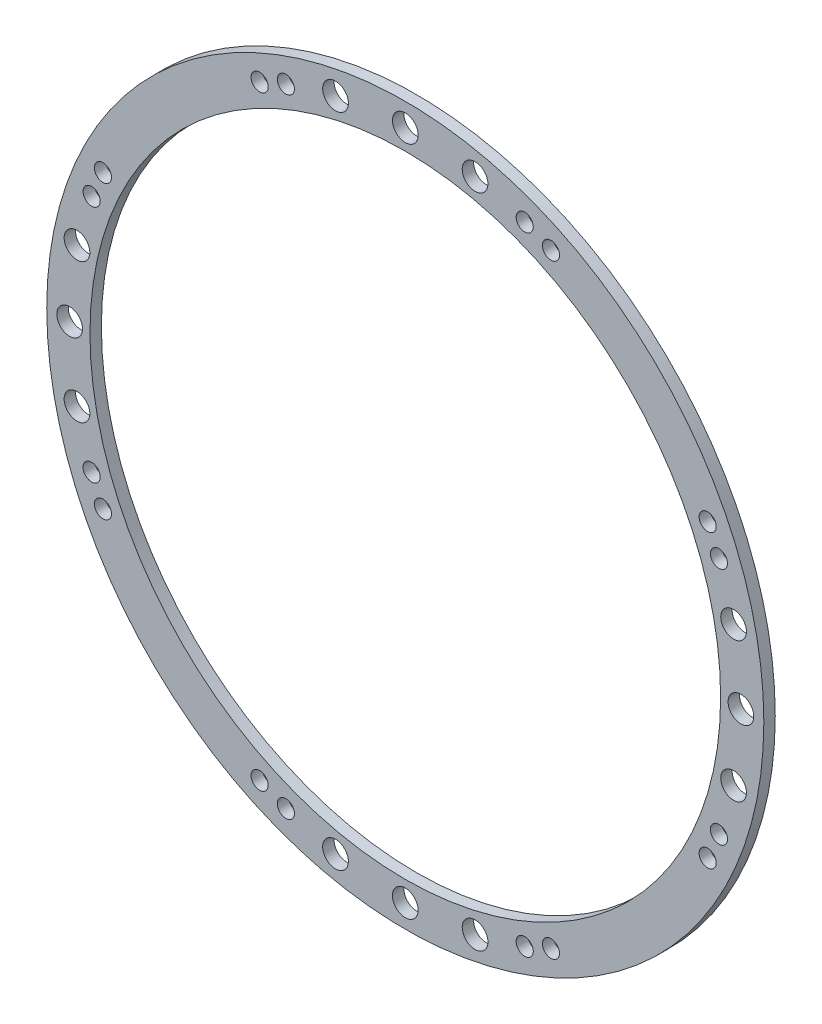
ISO-10303-21;
HEADER;
FILE_DESCRIPTION(('STEP AP214'),'2;1');
FILE_NAME('part.step','',(''),(''),'','','');
FILE_SCHEMA(('AUTOMOTIVE_DESIGN { 1 0 10303 214 1 1 1 1 }'));
ENDSEC;
DATA;
#1=APPLICATION_CONTEXT('core data for automotive mechanical design processes');
#2=APPLICATION_PROTOCOL_DEFINITION('international standard','automotive_design',2000,#1);
#3=PRODUCT_CONTEXT('',#1,'mechanical');
#4=PRODUCT('Part','Part','',(#3));
#5=PRODUCT_RELATED_PRODUCT_CATEGORY('part','',(#4));
#6=PRODUCT_DEFINITION_FORMATION('','',#4);
#7=PRODUCT_DEFINITION_CONTEXT('part definition',#1,'design');
#8=PRODUCT_DEFINITION('design','',#6,#7);
#9=PRODUCT_DEFINITION_SHAPE('','',#8);
#10=(LENGTH_UNIT() NAMED_UNIT(*) SI_UNIT(.MILLI.,.METRE.));
#11=(NAMED_UNIT(*) PLANE_ANGLE_UNIT() SI_UNIT($,.RADIAN.));
#12=(NAMED_UNIT(*) SI_UNIT($,.STERADIAN.) SOLID_ANGLE_UNIT());
#13=UNCERTAINTY_MEASURE_WITH_UNIT(LENGTH_MEASURE(1.E-05),#10,'distance_accuracy_value','');
#14=(GEOMETRIC_REPRESENTATION_CONTEXT(3) GLOBAL_UNCERTAINTY_ASSIGNED_CONTEXT((#13)) GLOBAL_UNIT_ASSIGNED_CONTEXT((#10,
#11,#12)) REPRESENTATION_CONTEXT('',''));
#15=CARTESIAN_POINT('',(0.,0.,0.));
#16=DIRECTION('',(0.,0.,1.));
#17=DIRECTION('',(1.,0.,0.));
#18=AXIS2_PLACEMENT_3D('',#15,#16,#17);
#19=CARTESIAN_POINT('',(0.,0.,1.6));
#20=DIRECTION('',(0.,0.,1.));
#21=DIRECTION('',(1.,0.,0.));
#22=AXIS2_PLACEMENT_3D('',#19,#20,#21);
#23=PLANE('',#22);
#24=CARTESIAN_POINT('',(20.393825861686,-42.3338158771823,1.6));
#25=DIRECTION('',(0.,0.,1.));
#26=DIRECTION('',(-1.,0.,0.));
#27=AXIS2_PLACEMENT_3D('',#24,#25,#26);
#28=CIRCLE('',#27,1.20000000000001);
#29=CARTESIAN_POINT('',(19.193825861686,-42.3338158771823,1.6));
#30=VERTEX_POINT('',#29);
#31=EDGE_CURVE('E159',#30,#30,#28,.T.);
#32=ORIENTED_EDGE('',*,*,#31,.F.);
#33=EDGE_LOOP('',(#32));
#34=FACE_BOUND('',#33,.T.);
#35=CARTESIAN_POINT('',(43.9148776335382,-16.7195580812188,1.6));
#36=DIRECTION('',(0.,0.,1.));
#37=DIRECTION('',(-1.,0.,0.));
#38=AXIS2_PLACEMENT_3D('',#35,#36,#37);
#39=CIRCLE('',#38,1.2);
#40=CARTESIAN_POINT('',(42.7148776335382,-16.7195580812188,1.6));
#41=VERTEX_POINT('',#40);
#42=EDGE_CURVE('E166',#41,#41,#39,.T.);
#43=ORIENTED_EDGE('',*,*,#42,.F.);
#44=EDGE_LOOP('',(#43));
#45=FACE_BOUND('',#44,.T.);
#46=CARTESIAN_POINT('',(42.3338158771812,-20.3938258616868,1.6));
#47=DIRECTION('',(0.,0.,1.));
#48=DIRECTION('',(-1.,0.,0.));
#49=AXIS2_PLACEMENT_3D('',#46,#47,#48);
#50=CIRCLE('',#49,1.2);
#51=CARTESIAN_POINT('',(41.1338158771812,-20.3938258616868,1.6));
#52=VERTEX_POINT('',#51);
#53=EDGE_CURVE('E147',#52,#52,#50,.T.);
#54=ORIENTED_EDGE('',*,*,#53,.F.);
#55=EDGE_LOOP('',(#54));
#56=FACE_BOUND('',#55,.T.);
#57=CARTESIAN_POINT('',(9.76977035152654,-45.9631557584815,1.6));
#58=DIRECTION('',(0.,0.,1.));
#59=DIRECTION('',(-1.,0.,0.));
#60=AXIS2_PLACEMENT_3D('',#57,#58,#59);
#61=CIRCLE('',#60,1.79999999999999);
#62=CARTESIAN_POINT('',(7.96977035152654,-45.9631557584815,1.6));
#63=VERTEX_POINT('',#62);
#64=EDGE_CURVE('E154',#63,#63,#61,.T.);
#65=ORIENTED_EDGE('',*,*,#64,.F.);
#66=EDGE_LOOP('',(#65));
#67=FACE_BOUND('',#66,.T.);
#68=CARTESIAN_POINT('',(16.719558081218,-43.9148776335393,1.6));
#69=DIRECTION('',(0.,0.,1.));
#70=DIRECTION('',(-1.,0.,0.));
#71=AXIS2_PLACEMENT_3D('',#68,#69,#70);
#72=CIRCLE('',#71,1.2);
#73=CARTESIAN_POINT('',(15.519558081218,-43.9148776335393,1.6));
#74=VERTEX_POINT('',#73);
#75=EDGE_CURVE('E184',#74,#74,#72,.T.);
#76=ORIENTED_EDGE('',*,*,#75,.F.);
#77=EDGE_LOOP('',(#76));
#78=FACE_BOUND('',#77,.T.);
#79=CARTESIAN_POINT('',(46.99,0.,1.6));
#80=DIRECTION('',(0.,0.,1.));
#81=DIRECTION('',(-1.,0.,0.));
#82=AXIS2_PLACEMENT_3D('',#79,#80,#81);
#83=CIRCLE('',#82,1.8);
#84=CARTESIAN_POINT('',(45.19,0.,1.6));
#85=VERTEX_POINT('',#84);
#86=EDGE_CURVE('E178',#85,#85,#83,.T.);
#87=ORIENTED_EDGE('',*,*,#86,.F.);
#88=EDGE_LOOP('',(#87));
#89=FACE_BOUND('',#88,.T.);
#90=CARTESIAN_POINT('',(9.76977035152449,45.9631557584806,1.6));
#91=DIRECTION('',(0.,0.,1.));
#92=DIRECTION('',(0.,-1.,0.));
#93=AXIS2_PLACEMENT_3D('',#90,#91,#92);
#94=CIRCLE('',#93,1.80000000000211);
#95=CARTESIAN_POINT('',(9.76977035152451,44.1631557584785,1.6));
#96=VERTEX_POINT('',#95);
#97=EDGE_CURVE('E171',#96,#96,#94,.T.);
#98=ORIENTED_EDGE('',*,*,#97,.F.);
#99=EDGE_LOOP('',(#98));
#100=FACE_BOUND('',#99,.T.);
#101=CARTESIAN_POINT('',(-42.3338158771823,-20.3938258616861,1.6));
#102=DIRECTION('',(0.,0.,1.));
#103=DIRECTION('',(0.,1.,0.));
#104=AXIS2_PLACEMENT_3D('',#101,#102,#103);
#105=CIRCLE('',#104,1.20000000000001);
#106=CARTESIAN_POINT('',(-42.3338158771823,-19.1938258616861,1.6));
#107=VERTEX_POINT('',#106);
#108=EDGE_CURVE('E117',#107,#107,#105,.T.);
#109=ORIENTED_EDGE('',*,*,#108,.F.);
#110=EDGE_LOOP('',(#109));
#111=FACE_BOUND('',#110,.T.);
#112=CARTESIAN_POINT('',(-16.7195580812187,-43.9148776335383,1.6));
#113=DIRECTION('',(0.,0.,1.));
#114=DIRECTION('',(0.,1.,0.));
#115=AXIS2_PLACEMENT_3D('',#112,#113,#114);
#116=CIRCLE('',#115,1.2);
#117=CARTESIAN_POINT('',(-16.7195580812187,-42.7148776335383,1.6));
#118=VERTEX_POINT('',#117);
#119=EDGE_CURVE('E124',#118,#118,#116,.T.);
#120=ORIENTED_EDGE('',*,*,#119,.F.);
#121=EDGE_LOOP('',(#120));
#122=FACE_BOUND('',#121,.T.);
#123=CARTESIAN_POINT('',(-20.3938258616867,-42.3338158771813,1.6));
#124=DIRECTION('',(0.,0.,1.));
#125=DIRECTION('',(0.,1.,0.));
#126=AXIS2_PLACEMENT_3D('',#123,#124,#125);
#127=CIRCLE('',#126,1.2);
#128=CARTESIAN_POINT('',(-20.3938258616867,-41.1338158771813,1.6));
#129=VERTEX_POINT('',#128);
#130=EDGE_CURVE('E105',#129,#129,#127,.T.);
#131=ORIENTED_EDGE('',*,*,#130,.F.);
#132=EDGE_LOOP('',(#131));
#133=FACE_BOUND('',#132,.T.);
#134=CARTESIAN_POINT('',(-45.9631557584815,-9.7697703515267,1.6));
#135=DIRECTION('',(0.,0.,1.));
#136=DIRECTION('',(0.,1.,0.));
#137=AXIS2_PLACEMENT_3D('',#134,#135,#136);
#138=CIRCLE('',#137,1.79999999999999);
#139=CARTESIAN_POINT('',(-45.9631557584815,-7.9697703515267,1.6));
#140=VERTEX_POINT('',#139);
#141=EDGE_CURVE('E112',#140,#140,#138,.T.);
#142=ORIENTED_EDGE('',*,*,#141,.F.);
#143=EDGE_LOOP('',(#142));
#144=FACE_BOUND('',#143,.T.);
#145=CARTESIAN_POINT('',(-43.9148776335393,-16.7195580812181,1.6));
#146=DIRECTION('',(0.,0.,1.));
#147=DIRECTION('',(0.,1.,0.));
#148=AXIS2_PLACEMENT_3D('',#145,#146,#147);
#149=CIRCLE('',#148,1.2);
#150=CARTESIAN_POINT('',(-43.9148776335393,-15.5195580812181,1.6));
#151=VERTEX_POINT('',#150);
#152=EDGE_CURVE('E142',#151,#151,#149,.T.);
#153=ORIENTED_EDGE('',*,*,#152,.F.);
#154=EDGE_LOOP('',(#153));
#155=FACE_BOUND('',#154,.T.);
#156=CARTESIAN_POINT('',(1.48899430224598E-13,-46.99,1.6));
#157=DIRECTION('',(0.,0.,1.));
#158=DIRECTION('',(0.,1.,0.));
#159=AXIS2_PLACEMENT_3D('',#156,#157,#158);
#160=CIRCLE('',#159,1.8);
#161=CARTESIAN_POINT('',(1.4261476381468E-13,-45.19,1.6));
#162=VERTEX_POINT('',#161);
#163=EDGE_CURVE('E136',#162,#162,#160,.T.);
#164=ORIENTED_EDGE('',*,*,#163,.F.);
#165=EDGE_LOOP('',(#164));
#166=FACE_BOUND('',#165,.T.);
#167=CARTESIAN_POINT('',(45.9631557584805,-9.76977035152497,1.6));
#168=DIRECTION('',(0.,0.,1.));
#169=DIRECTION('',(-1.,0.,0.));
#170=AXIS2_PLACEMENT_3D('',#167,#168,#169);
#171=CIRCLE('',#170,1.80000000000211);
#172=CARTESIAN_POINT('',(44.1631557584784,-9.76977035152497,1.6));
#173=VERTEX_POINT('',#172);
#174=EDGE_CURVE('E129',#173,#173,#171,.T.);
#175=ORIENTED_EDGE('',*,*,#174,.F.);
#176=EDGE_LOOP('',(#175));
#177=FACE_BOUND('',#176,.T.);
#178=CARTESIAN_POINT('',(43.9148776335392,16.7195580812185,1.6));
#179=DIRECTION('',(0.,0.,1.));
#180=DIRECTION('',(0.,-1.,0.));
#181=AXIS2_PLACEMENT_3D('',#178,#179,#180);
#182=CIRCLE('',#181,1.2);
#183=CARTESIAN_POINT('',(43.9148776335392,15.5195580812184,1.6));
#184=VERTEX_POINT('',#183);
#185=EDGE_CURVE('E213',#184,#184,#182,.T.);
#186=ORIENTED_EDGE('',*,*,#185,.F.);
#187=EDGE_LOOP('',(#186));
#188=FACE_BOUND('',#187,.T.);
#189=CARTESIAN_POINT('',(45.9631557584814,9.76977035152702,1.6));
#190=DIRECTION('',(0.,0.,1.));
#191=DIRECTION('',(0.,-1.,0.));
#192=AXIS2_PLACEMENT_3D('',#189,#190,#191);
#193=CIRCLE('',#192,1.79999999999999);
#194=CARTESIAN_POINT('',(45.9631557584814,7.96977035152702,1.6));
#195=VERTEX_POINT('',#194);
#196=EDGE_CURVE('E196',#195,#195,#193,.T.);
#197=ORIENTED_EDGE('',*,*,#196,.F.);
#198=EDGE_LOOP('',(#197));
#199=FACE_BOUND('',#198,.T.);
#200=CARTESIAN_POINT('',(20.3938258616864,42.3338158771814,1.6));
#201=DIRECTION('',(0.,0.,1.));
#202=DIRECTION('',(0.,-1.,0.));
#203=AXIS2_PLACEMENT_3D('',#200,#201,#202);
#204=CIRCLE('',#203,1.2);
#205=CARTESIAN_POINT('',(20.3938258616864,41.1338158771814,1.6));
#206=VERTEX_POINT('',#205);
#207=EDGE_CURVE('E189',#206,#206,#204,.T.);
#208=ORIENTED_EDGE('',*,*,#207,.F.);
#209=EDGE_LOOP('',(#208));
#210=FACE_BOUND('',#209,.T.);
#211=CARTESIAN_POINT('',(16.7195580812184,43.9148776335384,1.6));
#212=DIRECTION('',(0.,0.,1.));
#213=DIRECTION('',(0.,-1.,0.));
#214=AXIS2_PLACEMENT_3D('',#211,#212,#213);
#215=CIRCLE('',#214,1.2);
#216=CARTESIAN_POINT('',(16.7195580812184,42.7148776335384,1.6));
#217=VERTEX_POINT('',#216);
#218=EDGE_CURVE('E208',#217,#217,#215,.T.);
#219=ORIENTED_EDGE('',*,*,#218,.F.);
#220=EDGE_LOOP('',(#219));
#221=FACE_BOUND('',#220,.T.);
#222=CARTESIAN_POINT('',(42.3338158771821,20.3938258616864,1.6));
#223=DIRECTION('',(0.,0.,1.));
#224=DIRECTION('',(0.,-1.,0.));
#225=AXIS2_PLACEMENT_3D('',#222,#223,#224);
#226=CIRCLE('',#225,1.20000000000001);
#227=CARTESIAN_POINT('',(42.3338158771821,19.1938258616864,1.6));
#228=VERTEX_POINT('',#227);
#229=EDGE_CURVE('E201',#228,#228,#226,.T.);
#230=ORIENTED_EDGE('',*,*,#229,.F.);
#231=EDGE_LOOP('',(#230));
#232=FACE_BOUND('',#231,.T.);
#233=CARTESIAN_POINT('',(-9.76977035152481,-45.9631557584805,1.6));
#234=DIRECTION('',(0.,0.,1.));
#235=DIRECTION('',(0.,1.,0.));
#236=AXIS2_PLACEMENT_3D('',#233,#234,#235);
#237=CIRCLE('',#236,1.80000000000211);
#238=CARTESIAN_POINT('',(-9.76977035152482,-44.1631557584784,1.6));
#239=VERTEX_POINT('',#238);
#240=EDGE_CURVE('E99',#239,#239,#237,.T.);
#241=ORIENTED_EDGE('',*,*,#240,.F.);
#242=EDGE_LOOP('',(#241));
#243=FACE_BOUND('',#242,.T.);
#244=CARTESIAN_POINT('',(-20.393825861686,42.3338158771823,1.6));
#245=DIRECTION('',(0.,0.,1.));
#246=DIRECTION('',(1.,0.,0.));
#247=AXIS2_PLACEMENT_3D('',#244,#245,#246);
#248=CIRCLE('',#247,1.20000000000001);
#249=CARTESIAN_POINT('',(-19.193825861686,42.3338158771823,1.6));
#250=VERTEX_POINT('',#249);
#251=EDGE_CURVE('E69',#250,#250,#248,.T.);
#252=ORIENTED_EDGE('',*,*,#251,.F.);
#253=EDGE_LOOP('',(#252));
#254=FACE_BOUND('',#253,.T.);
#255=CARTESIAN_POINT('',(-43.9148776335382,16.7195580812188,1.6));
#256=DIRECTION('',(0.,0.,1.));
#257=DIRECTION('',(1.,0.,0.));
#258=AXIS2_PLACEMENT_3D('',#255,#256,#257);
#259=CIRCLE('',#258,1.2);
#260=CARTESIAN_POINT('',(-42.7148776335382,16.7195580812188,1.6));
#261=VERTEX_POINT('',#260);
#262=EDGE_CURVE('E76',#261,#261,#259,.T.);
#263=ORIENTED_EDGE('',*,*,#262,.F.);
#264=EDGE_LOOP('',(#263));
#265=FACE_BOUND('',#264,.T.);
#266=CARTESIAN_POINT('',(-42.3338158771812,20.3938258616868,1.6));
#267=DIRECTION('',(0.,0.,1.));
#268=DIRECTION('',(1.,0.,0.));
#269=AXIS2_PLACEMENT_3D('',#266,#267,#268);
#270=CIRCLE('',#269,1.2);
#271=CARTESIAN_POINT('',(-41.1338158771812,20.3938258616868,1.6));
#272=VERTEX_POINT('',#271);
#273=EDGE_CURVE('E57',#272,#272,#270,.T.);
#274=ORIENTED_EDGE('',*,*,#273,.F.);
#275=EDGE_LOOP('',(#274));
#276=FACE_BOUND('',#275,.T.);
#277=CARTESIAN_POINT('',(-9.76977035152654,45.9631557584815,1.6));
#278=DIRECTION('',(0.,0.,1.));
#279=DIRECTION('',(1.,0.,0.));
#280=AXIS2_PLACEMENT_3D('',#277,#278,#279);
#281=CIRCLE('',#280,1.79999999999999);
#282=CARTESIAN_POINT('',(-7.96977035152654,45.9631557584815,1.6));
#283=VERTEX_POINT('',#282);
#284=EDGE_CURVE('E64',#283,#283,#281,.T.);
#285=ORIENTED_EDGE('',*,*,#284,.F.);
#286=EDGE_LOOP('',(#285));
#287=FACE_BOUND('',#286,.T.);
#288=CARTESIAN_POINT('',(-16.719558081218,43.9148776335393,1.6));
#289=DIRECTION('',(0.,0.,1.));
#290=DIRECTION('',(1.,0.,0.));
#291=AXIS2_PLACEMENT_3D('',#288,#289,#290);
#292=CIRCLE('',#291,1.2);
#293=CARTESIAN_POINT('',(-15.519558081218,43.9148776335393,1.6));
#294=VERTEX_POINT('',#293);
#295=EDGE_CURVE('E94',#294,#294,#292,.T.);
#296=ORIENTED_EDGE('',*,*,#295,.F.);
#297=EDGE_LOOP('',(#296));
#298=FACE_BOUND('',#297,.T.);
#299=CARTESIAN_POINT('',(-46.99,0.,1.6));
#300=DIRECTION('',(0.,0.,1.));
#301=DIRECTION('',(1.,0.,0.));
#302=AXIS2_PLACEMENT_3D('',#299,#300,#301);
#303=CIRCLE('',#302,1.8);
#304=CARTESIAN_POINT('',(-45.19,0.,1.6));
#305=VERTEX_POINT('',#304);
#306=EDGE_CURVE('E88',#305,#305,#303,.T.);
#307=ORIENTED_EDGE('',*,*,#306,.F.);
#308=EDGE_LOOP('',(#307));
#309=FACE_BOUND('',#308,.T.);
#310=CARTESIAN_POINT('',(1.32790188144831E-12,46.9899999999987,1.6));
#311=DIRECTION('',(0.,0.,1.));
#312=DIRECTION('',(1.,0.,0.));
#313=AXIS2_PLACEMENT_3D('',#310,#311,#312);
#314=CIRCLE('',#313,1.80000000000211);
#315=CARTESIAN_POINT('',(1.80000000000344,46.9899999999987,1.6));
#316=VERTEX_POINT('',#315);
#317=EDGE_CURVE('E81',#316,#316,#314,.T.);
#318=ORIENTED_EDGE('',*,*,#317,.F.);
#319=EDGE_LOOP('',(#318));
#320=FACE_BOUND('',#319,.T.);
#321=CARTESIAN_POINT('',(-45.9631557584805,9.76977035152497,1.6));
#322=DIRECTION('',(0.,0.,1.));
#323=DIRECTION('',(1.,0.,0.));
#324=AXIS2_PLACEMENT_3D('',#321,#322,#323);
#325=CIRCLE('',#324,1.80000000000211);
#326=CARTESIAN_POINT('',(-44.1631557584784,9.76977035152497,1.6));
#327=VERTEX_POINT('',#326);
#328=EDGE_CURVE('E51',#327,#327,#325,.T.);
#329=ORIENTED_EDGE('',*,*,#328,.F.);
#330=EDGE_LOOP('',(#329));
#331=FACE_BOUND('',#330,.T.);
#332=CARTESIAN_POINT('',(0.,0.,1.6));
#333=DIRECTION('',(0.,0.,1.));
#334=DIRECTION('',(1.,0.,0.));
#335=AXIS2_PLACEMENT_3D('',#332,#333,#334);
#336=CIRCLE('',#335,50.2);
#337=CARTESIAN_POINT('',(50.2,0.,1.6));
#338=VERTEX_POINT('',#337);
#339=EDGE_CURVE('E10',#338,#338,#336,.T.);
#340=ORIENTED_EDGE('',*,*,#339,.T.);
#341=EDGE_LOOP('',(#340));
#342=FACE_BOUND('',#341,.T.);
#343=CARTESIAN_POINT('',(0.,0.,1.6));
#344=DIRECTION('',(0.,0.,1.));
#345=DIRECTION('',(1.,0.,0.));
#346=AXIS2_PLACEMENT_3D('',#343,#344,#345);
#347=CIRCLE('',#346,44.15);
#348=CARTESIAN_POINT('',(44.15,0.,1.6));
#349=VERTEX_POINT('',#348);
#350=EDGE_CURVE('E43',#349,#349,#347,.T.);
#351=ORIENTED_EDGE('',*,*,#350,.F.);
#352=EDGE_LOOP('',(#351));
#353=FACE_BOUND('',#352,.T.);
#354=ADVANCED_FACE('F32',(#34,#45,#56,#67,#78,#89,#100,#111,#122,#133,#144,#155,#166,#177,#188,
#199,#210,#221,#232,#243,#254,#265,#276,#287,#298,#309,#320,#331,#342,#353),#23,.T.);
#355=CARTESIAN_POINT('',(0.,0.,0.));
#356=DIRECTION('',(0.,0.,1.));
#357=DIRECTION('',(1.,0.,0.));
#358=AXIS2_PLACEMENT_3D('',#355,#356,#357);
#359=PLANE('',#358);
#360=CARTESIAN_POINT('',(20.393825861686,-42.3338158771823,0.));
#361=DIRECTION('',(0.,0.,1.));
#362=DIRECTION('',(-1.,0.,0.));
#363=AXIS2_PLACEMENT_3D('',#360,#361,#362);
#364=CIRCLE('',#363,1.20000000000001);
#365=CARTESIAN_POINT('',(19.193825861686,-42.3338158771823,0.));
#366=VERTEX_POINT('',#365);
#367=EDGE_CURVE('E162',#366,#366,#364,.T.);
#368=ORIENTED_EDGE('',*,*,#367,.T.);
#369=EDGE_LOOP('',(#368));
#370=FACE_BOUND('',#369,.T.);
#371=CARTESIAN_POINT('',(43.9148776335382,-16.7195580812188,0.));
#372=DIRECTION('',(0.,0.,1.));
#373=DIRECTION('',(-1.,0.,0.));
#374=AXIS2_PLACEMENT_3D('',#371,#372,#373);
#375=CIRCLE('',#374,1.2);
#376=CARTESIAN_POINT('',(42.7148776335382,-16.7195580812188,0.));
#377=VERTEX_POINT('',#376);
#378=EDGE_CURVE('E151',#377,#377,#375,.T.);
#379=ORIENTED_EDGE('',*,*,#378,.T.);
#380=EDGE_LOOP('',(#379));
#381=FACE_BOUND('',#380,.T.);
#382=CARTESIAN_POINT('',(42.3338158771812,-20.3938258616868,0.));
#383=DIRECTION('',(0.,0.,1.));
#384=DIRECTION('',(-1.,0.,0.));
#385=AXIS2_PLACEMENT_3D('',#382,#383,#384);
#386=CIRCLE('',#385,1.2);
#387=CARTESIAN_POINT('',(41.1338158771812,-20.3938258616868,0.));
#388=VERTEX_POINT('',#387);
#389=EDGE_CURVE('E150',#388,#388,#386,.T.);
#390=ORIENTED_EDGE('',*,*,#389,.T.);
#391=EDGE_LOOP('',(#390));
#392=FACE_BOUND('',#391,.T.);
#393=CARTESIAN_POINT('',(9.76977035152654,-45.9631557584815,0.));
#394=DIRECTION('',(0.,0.,1.));
#395=DIRECTION('',(-1.,0.,0.));
#396=AXIS2_PLACEMENT_3D('',#393,#394,#395);
#397=CIRCLE('',#396,1.79999999999999);
#398=CARTESIAN_POINT('',(7.96977035152654,-45.9631557584815,0.));
#399=VERTEX_POINT('',#398);
#400=EDGE_CURVE('E133',#399,#399,#397,.T.);
#401=ORIENTED_EDGE('',*,*,#400,.T.);
#402=EDGE_LOOP('',(#401));
#403=FACE_BOUND('',#402,.T.);
#404=CARTESIAN_POINT('',(16.719558081218,-43.9148776335393,0.));
#405=DIRECTION('',(0.,0.,1.));
#406=DIRECTION('',(-1.,0.,0.));
#407=AXIS2_PLACEMENT_3D('',#404,#405,#406);
#408=CIRCLE('',#407,1.2);
#409=CARTESIAN_POINT('',(15.519558081218,-43.9148776335393,0.));
#410=VERTEX_POINT('',#409);
#411=EDGE_CURVE('E163',#410,#410,#408,.T.);
#412=ORIENTED_EDGE('',*,*,#411,.T.);
#413=EDGE_LOOP('',(#412));
#414=FACE_BOUND('',#413,.T.);
#415=CARTESIAN_POINT('',(46.99,0.,0.));
#416=DIRECTION('',(0.,0.,1.));
#417=DIRECTION('',(-1.,0.,0.));
#418=AXIS2_PLACEMENT_3D('',#415,#416,#417);
#419=CIRCLE('',#418,1.8);
#420=CARTESIAN_POINT('',(45.19,0.,0.));
#421=VERTEX_POINT('',#420);
#422=EDGE_CURVE('E181',#421,#421,#419,.T.);
#423=ORIENTED_EDGE('',*,*,#422,.T.);
#424=EDGE_LOOP('',(#423));
#425=FACE_BOUND('',#424,.T.);
#426=CARTESIAN_POINT('',(9.76977035152449,45.9631557584806,0.));
#427=DIRECTION('',(0.,0.,1.));
#428=DIRECTION('',(0.,-1.,0.));
#429=AXIS2_PLACEMENT_3D('',#426,#427,#428);
#430=CIRCLE('',#429,1.80000000000211);
#431=CARTESIAN_POINT('',(9.76977035152451,44.1631557584785,0.));
#432=VERTEX_POINT('',#431);
#433=EDGE_CURVE('E174',#432,#432,#430,.T.);
#434=ORIENTED_EDGE('',*,*,#433,.T.);
#435=EDGE_LOOP('',(#434));
#436=FACE_BOUND('',#435,.T.);
#437=CARTESIAN_POINT('',(-42.3338158771823,-20.3938258616861,0.));
#438=DIRECTION('',(0.,0.,1.));
#439=DIRECTION('',(0.,1.,0.));
#440=AXIS2_PLACEMENT_3D('',#437,#438,#439);
#441=CIRCLE('',#440,1.20000000000001);
#442=CARTESIAN_POINT('',(-42.3338158771823,-19.1938258616861,0.));
#443=VERTEX_POINT('',#442);
#444=EDGE_CURVE('E120',#443,#443,#441,.T.);
#445=ORIENTED_EDGE('',*,*,#444,.T.);
#446=EDGE_LOOP('',(#445));
#447=FACE_BOUND('',#446,.T.);
#448=CARTESIAN_POINT('',(-16.7195580812187,-43.9148776335383,0.));
#449=DIRECTION('',(0.,0.,1.));
#450=DIRECTION('',(0.,1.,0.));
#451=AXIS2_PLACEMENT_3D('',#448,#449,#450);
#452=CIRCLE('',#451,1.2);
#453=CARTESIAN_POINT('',(-16.7195580812187,-42.7148776335383,0.));
#454=VERTEX_POINT('',#453);
#455=EDGE_CURVE('E109',#454,#454,#452,.T.);
#456=ORIENTED_EDGE('',*,*,#455,.T.);
#457=EDGE_LOOP('',(#456));
#458=FACE_BOUND('',#457,.T.);
#459=CARTESIAN_POINT('',(-20.3938258616867,-42.3338158771813,0.));
#460=DIRECTION('',(0.,0.,1.));
#461=DIRECTION('',(0.,1.,0.));
#462=AXIS2_PLACEMENT_3D('',#459,#460,#461);
#463=CIRCLE('',#462,1.2);
#464=CARTESIAN_POINT('',(-20.3938258616867,-41.1338158771813,0.));
#465=VERTEX_POINT('',#464);
#466=EDGE_CURVE('E108',#465,#465,#463,.T.);
#467=ORIENTED_EDGE('',*,*,#466,.T.);
#468=EDGE_LOOP('',(#467));
#469=FACE_BOUND('',#468,.T.);
#470=CARTESIAN_POINT('',(-45.9631557584815,-9.7697703515267,0.));
#471=DIRECTION('',(0.,0.,1.));
#472=DIRECTION('',(0.,1.,0.));
#473=AXIS2_PLACEMENT_3D('',#470,#471,#472);
#474=CIRCLE('',#473,1.79999999999999);
#475=CARTESIAN_POINT('',(-45.9631557584815,-7.9697703515267,0.));
#476=VERTEX_POINT('',#475);
#477=EDGE_CURVE('E102',#476,#476,#474,.T.);
#478=ORIENTED_EDGE('',*,*,#477,.T.);
#479=EDGE_LOOP('',(#478));
#480=FACE_BOUND('',#479,.T.);
#481=CARTESIAN_POINT('',(-43.9148776335393,-16.7195580812181,0.));
#482=DIRECTION('',(0.,0.,1.));
#483=DIRECTION('',(0.,1.,0.));
#484=AXIS2_PLACEMENT_3D('',#481,#482,#483);
#485=CIRCLE('',#484,1.2);
#486=CARTESIAN_POINT('',(-43.9148776335393,-15.5195580812181,0.));
#487=VERTEX_POINT('',#486);
#488=EDGE_CURVE('E121',#487,#487,#485,.T.);
#489=ORIENTED_EDGE('',*,*,#488,.T.);
#490=EDGE_LOOP('',(#489));
#491=FACE_BOUND('',#490,.T.);
#492=CARTESIAN_POINT('',(1.48899430224598E-13,-46.99,0.));
#493=DIRECTION('',(0.,0.,1.));
#494=DIRECTION('',(0.,1.,0.));
#495=AXIS2_PLACEMENT_3D('',#492,#493,#494);
#496=CIRCLE('',#495,1.8);
#497=CARTESIAN_POINT('',(1.4261476381468E-13,-45.19,0.));
#498=VERTEX_POINT('',#497);
#499=EDGE_CURVE('E139',#498,#498,#496,.T.);
#500=ORIENTED_EDGE('',*,*,#499,.T.);
#501=EDGE_LOOP('',(#500));
#502=FACE_BOUND('',#501,.T.);
#503=CARTESIAN_POINT('',(45.9631557584805,-9.76977035152497,0.));
#504=DIRECTION('',(0.,0.,1.));
#505=DIRECTION('',(-1.,0.,0.));
#506=AXIS2_PLACEMENT_3D('',#503,#504,#505);
#507=CIRCLE('',#506,1.80000000000211);
#508=CARTESIAN_POINT('',(44.1631557584784,-9.76977035152497,0.));
#509=VERTEX_POINT('',#508);
#510=EDGE_CURVE('E132',#509,#509,#507,.T.);
#511=ORIENTED_EDGE('',*,*,#510,.T.);
#512=EDGE_LOOP('',(#511));
#513=FACE_BOUND('',#512,.T.);
#514=CARTESIAN_POINT('',(43.9148776335392,16.7195580812185,0.));
#515=DIRECTION('',(0.,0.,1.));
#516=DIRECTION('',(0.,-1.,0.));
#517=AXIS2_PLACEMENT_3D('',#514,#515,#516);
#518=CIRCLE('',#517,1.2);
#519=CARTESIAN_POINT('',(43.9148776335392,15.5195580812184,0.));
#520=VERTEX_POINT('',#519);
#521=EDGE_CURVE('E205',#520,#520,#518,.T.);
#522=ORIENTED_EDGE('',*,*,#521,.T.);
#523=EDGE_LOOP('',(#522));
#524=FACE_BOUND('',#523,.T.);
#525=CARTESIAN_POINT('',(45.9631557584814,9.76977035152702,0.));
#526=DIRECTION('',(0.,0.,1.));
#527=DIRECTION('',(0.,-1.,0.));
#528=AXIS2_PLACEMENT_3D('',#525,#526,#527);
#529=CIRCLE('',#528,1.79999999999999);
#530=CARTESIAN_POINT('',(45.9631557584814,7.96977035152702,0.));
#531=VERTEX_POINT('',#530);
#532=EDGE_CURVE('E175',#531,#531,#529,.T.);
#533=ORIENTED_EDGE('',*,*,#532,.T.);
#534=EDGE_LOOP('',(#533));
#535=FACE_BOUND('',#534,.T.);
#536=CARTESIAN_POINT('',(20.3938258616864,42.3338158771814,0.));
#537=DIRECTION('',(0.,0.,1.));
#538=DIRECTION('',(0.,-1.,0.));
#539=AXIS2_PLACEMENT_3D('',#536,#537,#538);
#540=CIRCLE('',#539,1.2);
#541=CARTESIAN_POINT('',(20.3938258616864,41.1338158771814,0.));
#542=VERTEX_POINT('',#541);
#543=EDGE_CURVE('E192',#542,#542,#540,.T.);
#544=ORIENTED_EDGE('',*,*,#543,.T.);
#545=EDGE_LOOP('',(#544));
#546=FACE_BOUND('',#545,.T.);
#547=CARTESIAN_POINT('',(16.7195580812184,43.9148776335384,0.));
#548=DIRECTION('',(0.,0.,1.));
#549=DIRECTION('',(0.,-1.,0.));
#550=AXIS2_PLACEMENT_3D('',#547,#548,#549);
#551=CIRCLE('',#550,1.2);
#552=CARTESIAN_POINT('',(16.7195580812184,42.7148776335384,0.));
#553=VERTEX_POINT('',#552);
#554=EDGE_CURVE('E193',#553,#553,#551,.T.);
#555=ORIENTED_EDGE('',*,*,#554,.T.);
#556=EDGE_LOOP('',(#555));
#557=FACE_BOUND('',#556,.T.);
#558=CARTESIAN_POINT('',(42.3338158771821,20.3938258616864,0.));
#559=DIRECTION('',(0.,0.,1.));
#560=DIRECTION('',(0.,-1.,0.));
#561=AXIS2_PLACEMENT_3D('',#558,#559,#560);
#562=CIRCLE('',#561,1.20000000000001);
#563=CARTESIAN_POINT('',(42.3338158771821,19.1938258616864,0.));
#564=VERTEX_POINT('',#563);
#565=EDGE_CURVE('E204',#564,#564,#562,.T.);
#566=ORIENTED_EDGE('',*,*,#565,.T.);
#567=EDGE_LOOP('',(#566));
#568=FACE_BOUND('',#567,.T.);
#569=CARTESIAN_POINT('',(-9.76977035152481,-45.9631557584805,0.));
#570=DIRECTION('',(0.,0.,1.));
#571=DIRECTION('',(0.,1.,0.));
#572=AXIS2_PLACEMENT_3D('',#569,#570,#571);
#573=CIRCLE('',#572,1.80000000000211);
#574=CARTESIAN_POINT('',(-9.76977035152482,-44.1631557584784,0.));
#575=VERTEX_POINT('',#574);
#576=EDGE_CURVE('E85',#575,#575,#573,.T.);
#577=ORIENTED_EDGE('',*,*,#576,.T.);
#578=EDGE_LOOP('',(#577));
#579=FACE_BOUND('',#578,.T.);
#580=CARTESIAN_POINT('',(-20.393825861686,42.3338158771823,0.));
#581=DIRECTION('',(0.,0.,1.));
#582=DIRECTION('',(1.,0.,0.));
#583=AXIS2_PLACEMENT_3D('',#580,#581,#582);
#584=CIRCLE('',#583,1.20000000000001);
#585=CARTESIAN_POINT('',(-19.193825861686,42.3338158771823,0.));
#586=VERTEX_POINT('',#585);
#587=EDGE_CURVE('E72',#586,#586,#584,.T.);
#588=ORIENTED_EDGE('',*,*,#587,.T.);
#589=EDGE_LOOP('',(#588));
#590=FACE_BOUND('',#589,.T.);
#591=CARTESIAN_POINT('',(-43.9148776335382,16.7195580812188,0.));
#592=DIRECTION('',(0.,0.,1.));
#593=DIRECTION('',(1.,0.,0.));
#594=AXIS2_PLACEMENT_3D('',#591,#592,#593);
#595=CIRCLE('',#594,1.2);
#596=CARTESIAN_POINT('',(-42.7148776335382,16.7195580812188,0.));
#597=VERTEX_POINT('',#596);
#598=EDGE_CURVE('E61',#597,#597,#595,.T.);
#599=ORIENTED_EDGE('',*,*,#598,.T.);
#600=EDGE_LOOP('',(#599));
#601=FACE_BOUND('',#600,.T.);
#602=CARTESIAN_POINT('',(-42.3338158771812,20.3938258616868,0.));
#603=DIRECTION('',(0.,0.,1.));
#604=DIRECTION('',(1.,0.,0.));
#605=AXIS2_PLACEMENT_3D('',#602,#603,#604);
#606=CIRCLE('',#605,1.2);
#607=CARTESIAN_POINT('',(-41.1338158771812,20.3938258616868,0.));
#608=VERTEX_POINT('',#607);
#609=EDGE_CURVE('E60',#608,#608,#606,.T.);
#610=ORIENTED_EDGE('',*,*,#609,.T.);
#611=EDGE_LOOP('',(#610));
#612=FACE_BOUND('',#611,.T.);
#613=CARTESIAN_POINT('',(-9.76977035152654,45.9631557584815,0.));
#614=DIRECTION('',(0.,0.,1.));
#615=DIRECTION('',(1.,0.,0.));
#616=AXIS2_PLACEMENT_3D('',#613,#614,#615);
#617=CIRCLE('',#616,1.79999999999999);
#618=CARTESIAN_POINT('',(-7.96977035152654,45.9631557584815,0.));
#619=VERTEX_POINT('',#618);
#620=EDGE_CURVE('E54',#619,#619,#617,.T.);
#621=ORIENTED_EDGE('',*,*,#620,.T.);
#622=EDGE_LOOP('',(#621));
#623=FACE_BOUND('',#622,.T.);
#624=CARTESIAN_POINT('',(-16.719558081218,43.9148776335393,0.));
#625=DIRECTION('',(0.,0.,1.));
#626=DIRECTION('',(1.,0.,0.));
#627=AXIS2_PLACEMENT_3D('',#624,#625,#626);
#628=CIRCLE('',#627,1.2);
#629=CARTESIAN_POINT('',(-15.519558081218,43.9148776335393,0.));
#630=VERTEX_POINT('',#629);
#631=EDGE_CURVE('E73',#630,#630,#628,.T.);
#632=ORIENTED_EDGE('',*,*,#631,.T.);
#633=EDGE_LOOP('',(#632));
#634=FACE_BOUND('',#633,.T.);
#635=CARTESIAN_POINT('',(-46.99,0.,0.));
#636=DIRECTION('',(0.,0.,1.));
#637=DIRECTION('',(1.,0.,0.));
#638=AXIS2_PLACEMENT_3D('',#635,#636,#637);
#639=CIRCLE('',#638,1.8);
#640=CARTESIAN_POINT('',(-45.19,0.,0.));
#641=VERTEX_POINT('',#640);
#642=EDGE_CURVE('E91',#641,#641,#639,.T.);
#643=ORIENTED_EDGE('',*,*,#642,.T.);
#644=EDGE_LOOP('',(#643));
#645=FACE_BOUND('',#644,.T.);
#646=CARTESIAN_POINT('',(1.32790188144831E-12,46.9899999999987,0.));
#647=DIRECTION('',(0.,0.,1.));
#648=DIRECTION('',(1.,0.,0.));
#649=AXIS2_PLACEMENT_3D('',#646,#647,#648);
#650=CIRCLE('',#649,1.80000000000211);
#651=CARTESIAN_POINT('',(1.80000000000344,46.9899999999987,0.));
#652=VERTEX_POINT('',#651);
#653=EDGE_CURVE('E84',#652,#652,#650,.T.);
#654=ORIENTED_EDGE('',*,*,#653,.T.);
#655=EDGE_LOOP('',(#654));
#656=FACE_BOUND('',#655,.T.);
#657=CARTESIAN_POINT('',(-45.9631557584805,9.76977035152497,0.));
#658=DIRECTION('',(0.,0.,1.));
#659=DIRECTION('',(1.,0.,0.));
#660=AXIS2_PLACEMENT_3D('',#657,#658,#659);
#661=CIRCLE('',#660,1.80000000000211);
#662=CARTESIAN_POINT('',(-44.1631557584784,9.76977035152497,0.));
#663=VERTEX_POINT('',#662);
#664=EDGE_CURVE('E48',#663,#663,#661,.T.);
#665=ORIENTED_EDGE('',*,*,#664,.T.);
#666=EDGE_LOOP('',(#665));
#667=FACE_BOUND('',#666,.T.);
#668=CARTESIAN_POINT('',(0.,0.,0.));
#669=DIRECTION('',(0.,0.,1.));
#670=DIRECTION('',(1.,0.,0.));
#671=AXIS2_PLACEMENT_3D('',#668,#669,#670);
#672=CIRCLE('',#671,50.2);
#673=CARTESIAN_POINT('',(50.2,0.,0.));
#674=VERTEX_POINT('',#673);
#675=EDGE_CURVE('E36',#674,#674,#672,.T.);
#676=ORIENTED_EDGE('',*,*,#675,.F.);
#677=EDGE_LOOP('',(#676));
#678=FACE_BOUND('',#677,.T.);
#679=CARTESIAN_POINT('',(0.,0.,0.));
#680=DIRECTION('',(0.,0.,1.));
#681=DIRECTION('',(1.,0.,0.));
#682=AXIS2_PLACEMENT_3D('',#679,#680,#681);
#683=CIRCLE('',#682,44.15);
#684=CARTESIAN_POINT('',(44.15,0.,0.));
#685=VERTEX_POINT('',#684);
#686=EDGE_CURVE('E45',#685,#685,#683,.T.);
#687=ORIENTED_EDGE('',*,*,#686,.T.);
#688=EDGE_LOOP('',(#687));
#689=FACE_BOUND('',#688,.T.);
#690=ADVANCED_FACE('F219',(#370,#381,#392,#403,#414,#425,#436,#447,#458,#469,#480,#491,#502,
#513,#524,#535,#546,#557,#568,#579,#590,#601,#612,#623,#634,#645,#656,#667,#678,#689),#359,.F.);
#691=CARTESIAN_POINT('',(0.,0.,1.6));
#692=DIRECTION('',(0.,0.,-1.));
#693=DIRECTION('',(-1.,0.,0.));
#694=AXIS2_PLACEMENT_3D('',#691,#692,#693);
#695=CYLINDRICAL_SURFACE('',#694,50.2);
#696=ORIENTED_EDGE('',*,*,#339,.F.);
#697=EDGE_LOOP('',(#696));
#698=FACE_BOUND('',#697,.T.);
#699=ORIENTED_EDGE('',*,*,#675,.T.);
#700=EDGE_LOOP('',(#699));
#701=FACE_BOUND('',#700,.T.);
#702=ADVANCED_FACE('F34',(#698,#701),#695,.T.);
#703=CARTESIAN_POINT('',(0.,0.,1.6));
#704=DIRECTION('',(0.,0.,-1.));
#705=DIRECTION('',(-1.,0.,0.));
#706=AXIS2_PLACEMENT_3D('',#703,#704,#705);
#707=CYLINDRICAL_SURFACE('',#706,44.15);
#708=ORIENTED_EDGE('',*,*,#350,.T.);
#709=EDGE_LOOP('',(#708));
#710=FACE_BOUND('',#709,.T.);
#711=ORIENTED_EDGE('',*,*,#686,.F.);
#712=EDGE_LOOP('',(#711));
#713=FACE_BOUND('',#712,.T.);
#714=ADVANCED_FACE('F262',(#710,#713),#707,.F.);
#715=CARTESIAN_POINT('',(-45.9631557584805,9.76977035152497,0.));
#716=DIRECTION('',(0.,0.,1.));
#717=DIRECTION('',(1.,0.,0.));
#718=AXIS2_PLACEMENT_3D('',#715,#716,#717);
#719=CYLINDRICAL_SURFACE('',#718,1.80000000000211);
#720=ORIENTED_EDGE('',*,*,#664,.F.);
#721=EDGE_LOOP('',(#720));
#722=FACE_BOUND('',#721,.T.);
#723=ORIENTED_EDGE('',*,*,#328,.T.);
#724=EDGE_LOOP('',(#723));
#725=FACE_BOUND('',#724,.T.);
#726=ADVANCED_FACE('F265',(#722,#725),#719,.F.);
#727=CARTESIAN_POINT('',(1.32790188144831E-12,46.9899999999987,0.));
#728=DIRECTION('',(0.,0.,1.));
#729=DIRECTION('',(1.,0.,0.));
#730=AXIS2_PLACEMENT_3D('',#727,#728,#729);
#731=CYLINDRICAL_SURFACE('',#730,1.80000000000211);
#732=ORIENTED_EDGE('',*,*,#653,.F.);
#733=EDGE_LOOP('',(#732));
#734=FACE_BOUND('',#733,.T.);
#735=ORIENTED_EDGE('',*,*,#317,.T.);
#736=EDGE_LOOP('',(#735));
#737=FACE_BOUND('',#736,.T.);
#738=ADVANCED_FACE('F279',(#734,#737),#731,.F.);
#739=CARTESIAN_POINT('',(-46.99,0.,0.));
#740=DIRECTION('',(0.,0.,1.));
#741=DIRECTION('',(1.,0.,0.));
#742=AXIS2_PLACEMENT_3D('',#739,#740,#741);
#743=CYLINDRICAL_SURFACE('',#742,1.8);
#744=ORIENTED_EDGE('',*,*,#642,.F.);
#745=EDGE_LOOP('',(#744));
#746=FACE_BOUND('',#745,.T.);
#747=ORIENTED_EDGE('',*,*,#306,.T.);
#748=EDGE_LOOP('',(#747));
#749=FACE_BOUND('',#748,.T.);
#750=ADVANCED_FACE('F301',(#746,#749),#743,.F.);
#751=CARTESIAN_POINT('',(-16.719558081218,43.9148776335393,0.));
#752=DIRECTION('',(0.,0.,1.));
#753=DIRECTION('',(1.,0.,0.));
#754=AXIS2_PLACEMENT_3D('',#751,#752,#753);
#755=CYLINDRICAL_SURFACE('',#754,1.2);
#756=ORIENTED_EDGE('',*,*,#631,.F.);
#757=EDGE_LOOP('',(#756));
#758=FACE_BOUND('',#757,.T.);
#759=ORIENTED_EDGE('',*,*,#295,.T.);
#760=EDGE_LOOP('',(#759));
#761=FACE_BOUND('',#760,.T.);
#762=ADVANCED_FACE('F289',(#758,#761),#755,.F.);
#763=CARTESIAN_POINT('',(-9.76977035152654,45.9631557584815,0.));
#764=DIRECTION('',(0.,0.,1.));
#765=DIRECTION('',(1.,0.,0.));
#766=AXIS2_PLACEMENT_3D('',#763,#764,#765);
#767=CYLINDRICAL_SURFACE('',#766,1.79999999999999);
#768=ORIENTED_EDGE('',*,*,#620,.F.);
#769=EDGE_LOOP('',(#768));
#770=FACE_BOUND('',#769,.T.);
#771=ORIENTED_EDGE('',*,*,#284,.T.);
#772=EDGE_LOOP('',(#771));
#773=FACE_BOUND('',#772,.T.);
#774=ADVANCED_FACE('F285',(#770,#773),#767,.F.);
#775=CARTESIAN_POINT('',(-42.3338158771812,20.3938258616868,0.));
#776=DIRECTION('',(0.,0.,1.));
#777=DIRECTION('',(1.,0.,0.));
#778=AXIS2_PLACEMENT_3D('',#775,#776,#777);
#779=CYLINDRICAL_SURFACE('',#778,1.2);
#780=ORIENTED_EDGE('',*,*,#609,.F.);
#781=EDGE_LOOP('',(#780));
#782=FACE_BOUND('',#781,.T.);
#783=ORIENTED_EDGE('',*,*,#273,.T.);
#784=EDGE_LOOP('',(#783));
#785=FACE_BOUND('',#784,.T.);
#786=ADVANCED_FACE('F281',(#782,#785),#779,.F.);
#787=CARTESIAN_POINT('',(-43.9148776335382,16.7195580812188,0.));
#788=DIRECTION('',(0.,0.,1.));
#789=DIRECTION('',(1.,0.,0.));
#790=AXIS2_PLACEMENT_3D('',#787,#788,#789);
#791=CYLINDRICAL_SURFACE('',#790,1.2);
#792=ORIENTED_EDGE('',*,*,#598,.F.);
#793=EDGE_LOOP('',(#792));
#794=FACE_BOUND('',#793,.T.);
#795=ORIENTED_EDGE('',*,*,#262,.T.);
#796=EDGE_LOOP('',(#795));
#797=FACE_BOUND('',#796,.T.);
#798=ADVANCED_FACE('F284',(#794,#797),#791,.F.);
#799=CARTESIAN_POINT('',(-20.393825861686,42.3338158771823,0.));
#800=DIRECTION('',(0.,0.,1.));
#801=DIRECTION('',(1.,0.,0.));
#802=AXIS2_PLACEMENT_3D('',#799,#800,#801);
#803=CYLINDRICAL_SURFACE('',#802,1.20000000000001);
#804=ORIENTED_EDGE('',*,*,#587,.F.);
#805=EDGE_LOOP('',(#804));
#806=FACE_BOUND('',#805,.T.);
#807=ORIENTED_EDGE('',*,*,#251,.T.);
#808=EDGE_LOOP('',(#807));
#809=FACE_BOUND('',#808,.T.);
#810=ADVANCED_FACE('F291',(#806,#809),#803,.F.);
#811=CARTESIAN_POINT('',(-9.76977035152481,-45.9631557584805,0.));
#812=DIRECTION('',(0.,0.,1.));
#813=DIRECTION('',(1.,0.,0.));
#814=AXIS2_PLACEMENT_3D('',#811,#812,#813);
#815=CYLINDRICAL_SURFACE('',#814,1.80000000000211);
#816=ORIENTED_EDGE('',*,*,#576,.F.);
#817=EDGE_LOOP('',(#816));
#818=FACE_BOUND('',#817,.T.);
#819=ORIENTED_EDGE('',*,*,#240,.T.);
#820=EDGE_LOOP('',(#819));
#821=FACE_BOUND('',#820,.T.);
#822=ADVANCED_FACE('F294',(#818,#821),#815,.F.);
#823=CARTESIAN_POINT('',(42.3338158771821,20.3938258616864,0.));
#824=DIRECTION('',(0.,0.,1.));
#825=DIRECTION('',(1.,0.,0.));
#826=AXIS2_PLACEMENT_3D('',#823,#824,#825);
#827=CYLINDRICAL_SURFACE('',#826,1.20000000000001);
#828=ORIENTED_EDGE('',*,*,#565,.F.);
#829=EDGE_LOOP('',(#828));
#830=FACE_BOUND('',#829,.T.);
#831=ORIENTED_EDGE('',*,*,#229,.T.);
#832=EDGE_LOOP('',(#831));
#833=FACE_BOUND('',#832,.T.);
#834=ADVANCED_FACE('F311',(#830,#833),#827,.F.);
#835=CARTESIAN_POINT('',(16.7195580812184,43.9148776335384,0.));
#836=DIRECTION('',(0.,0.,1.));
#837=DIRECTION('',(1.,0.,0.));
#838=AXIS2_PLACEMENT_3D('',#835,#836,#837);
#839=CYLINDRICAL_SURFACE('',#838,1.2);
#840=ORIENTED_EDGE('',*,*,#554,.F.);
#841=EDGE_LOOP('',(#840));
#842=FACE_BOUND('',#841,.T.);
#843=ORIENTED_EDGE('',*,*,#218,.T.);
#844=EDGE_LOOP('',(#843));
#845=FACE_BOUND('',#844,.T.);
#846=ADVANCED_FACE('F371',(#842,#845),#839,.F.);
#847=CARTESIAN_POINT('',(20.3938258616864,42.3338158771814,0.));
#848=DIRECTION('',(0.,0.,1.));
#849=DIRECTION('',(1.,0.,0.));
#850=AXIS2_PLACEMENT_3D('',#847,#848,#849);
#851=CYLINDRICAL_SURFACE('',#850,1.2);
#852=ORIENTED_EDGE('',*,*,#543,.F.);
#853=EDGE_LOOP('',(#852));
#854=FACE_BOUND('',#853,.T.);
#855=ORIENTED_EDGE('',*,*,#207,.T.);
#856=EDGE_LOOP('',(#855));
#857=FACE_BOUND('',#856,.T.);
#858=ADVANCED_FACE('F368',(#854,#857),#851,.F.);
#859=CARTESIAN_POINT('',(45.9631557584814,9.76977035152702,0.));
#860=DIRECTION('',(0.,0.,1.));
#861=DIRECTION('',(1.,0.,0.));
#862=AXIS2_PLACEMENT_3D('',#859,#860,#861);
#863=CYLINDRICAL_SURFACE('',#862,1.79999999999999);
#864=ORIENTED_EDGE('',*,*,#532,.F.);
#865=EDGE_LOOP('',(#864));
#866=FACE_BOUND('',#865,.T.);
#867=ORIENTED_EDGE('',*,*,#196,.T.);
#868=EDGE_LOOP('',(#867));
#869=FACE_BOUND('',#868,.T.);
#870=ADVANCED_FACE('F226',(#866,#869),#863,.F.);
#871=CARTESIAN_POINT('',(43.9148776335392,16.7195580812185,0.));
#872=DIRECTION('',(0.,0.,1.));
#873=DIRECTION('',(1.,0.,0.));
#874=AXIS2_PLACEMENT_3D('',#871,#872,#873);
#875=CYLINDRICAL_SURFACE('',#874,1.2);
#876=ORIENTED_EDGE('',*,*,#521,.F.);
#877=EDGE_LOOP('',(#876));
#878=FACE_BOUND('',#877,.T.);
#879=ORIENTED_EDGE('',*,*,#185,.T.);
#880=EDGE_LOOP('',(#879));
#881=FACE_BOUND('',#880,.T.);
#882=ADVANCED_FACE('F222',(#878,#881),#875,.F.);
#883=CARTESIAN_POINT('',(45.9631557584805,-9.76977035152497,0.));
#884=DIRECTION('',(0.,0.,1.));
#885=DIRECTION('',(1.,0.,0.));
#886=AXIS2_PLACEMENT_3D('',#883,#884,#885);
#887=CYLINDRICAL_SURFACE('',#886,1.80000000000211);
#888=ORIENTED_EDGE('',*,*,#510,.F.);
#889=EDGE_LOOP('',(#888));
#890=FACE_BOUND('',#889,.T.);
#891=ORIENTED_EDGE('',*,*,#174,.T.);
#892=EDGE_LOOP('',(#891));
#893=FACE_BOUND('',#892,.T.);
#894=ADVANCED_FACE('F225',(#890,#893),#887,.F.);
#895=CARTESIAN_POINT('',(1.48899430224598E-13,-46.99,0.));
#896=DIRECTION('',(0.,0.,1.));
#897=DIRECTION('',(1.,0.,0.));
#898=AXIS2_PLACEMENT_3D('',#895,#896,#897);
#899=CYLINDRICAL_SURFACE('',#898,1.8);
#900=ORIENTED_EDGE('',*,*,#499,.F.);
#901=EDGE_LOOP('',(#900));
#902=FACE_BOUND('',#901,.T.);
#903=ORIENTED_EDGE('',*,*,#163,.T.);
#904=EDGE_LOOP('',(#903));
#905=FACE_BOUND('',#904,.T.);
#906=ADVANCED_FACE('F333',(#902,#905),#899,.F.);
#907=CARTESIAN_POINT('',(-43.9148776335393,-16.7195580812181,0.));
#908=DIRECTION('',(0.,0.,1.));
#909=DIRECTION('',(1.,0.,0.));
#910=AXIS2_PLACEMENT_3D('',#907,#908,#909);
#911=CYLINDRICAL_SURFACE('',#910,1.2);
#912=ORIENTED_EDGE('',*,*,#488,.F.);
#913=EDGE_LOOP('',(#912));
#914=FACE_BOUND('',#913,.T.);
#915=ORIENTED_EDGE('',*,*,#152,.T.);
#916=EDGE_LOOP('',(#915));
#917=FACE_BOUND('',#916,.T.);
#918=ADVANCED_FACE('F321',(#914,#917),#911,.F.);
#919=CARTESIAN_POINT('',(-45.9631557584815,-9.7697703515267,0.));
#920=DIRECTION('',(0.,0.,1.));
#921=DIRECTION('',(1.,0.,0.));
#922=AXIS2_PLACEMENT_3D('',#919,#920,#921);
#923=CYLINDRICAL_SURFACE('',#922,1.79999999999999);
#924=ORIENTED_EDGE('',*,*,#477,.F.);
#925=EDGE_LOOP('',(#924));
#926=FACE_BOUND('',#925,.T.);
#927=ORIENTED_EDGE('',*,*,#141,.T.);
#928=EDGE_LOOP('',(#927));
#929=FACE_BOUND('',#928,.T.);
#930=ADVANCED_FACE('F317',(#926,#929),#923,.F.);
#931=CARTESIAN_POINT('',(-20.3938258616867,-42.3338158771813,0.));
#932=DIRECTION('',(0.,0.,1.));
#933=DIRECTION('',(1.,0.,0.));
#934=AXIS2_PLACEMENT_3D('',#931,#932,#933);
#935=CYLINDRICAL_SURFACE('',#934,1.2);
#936=ORIENTED_EDGE('',*,*,#466,.F.);
#937=EDGE_LOOP('',(#936));
#938=FACE_BOUND('',#937,.T.);
#939=ORIENTED_EDGE('',*,*,#130,.T.);
#940=EDGE_LOOP('',(#939));
#941=FACE_BOUND('',#940,.T.);
#942=ADVANCED_FACE('F313',(#938,#941),#935,.F.);
#943=CARTESIAN_POINT('',(-16.7195580812187,-43.9148776335383,0.));
#944=DIRECTION('',(0.,0.,1.));
#945=DIRECTION('',(1.,0.,0.));
#946=AXIS2_PLACEMENT_3D('',#943,#944,#945);
#947=CYLINDRICAL_SURFACE('',#946,1.2);
#948=ORIENTED_EDGE('',*,*,#455,.F.);
#949=EDGE_LOOP('',(#948));
#950=FACE_BOUND('',#949,.T.);
#951=ORIENTED_EDGE('',*,*,#119,.T.);
#952=EDGE_LOOP('',(#951));
#953=FACE_BOUND('',#952,.T.);
#954=ADVANCED_FACE('F316',(#950,#953),#947,.F.);
#955=CARTESIAN_POINT('',(-42.3338158771823,-20.3938258616861,0.));
#956=DIRECTION('',(0.,0.,1.));
#957=DIRECTION('',(1.,0.,0.));
#958=AXIS2_PLACEMENT_3D('',#955,#956,#957);
#959=CYLINDRICAL_SURFACE('',#958,1.20000000000001);
#960=ORIENTED_EDGE('',*,*,#444,.F.);
#961=EDGE_LOOP('',(#960));
#962=FACE_BOUND('',#961,.T.);
#963=ORIENTED_EDGE('',*,*,#108,.T.);
#964=EDGE_LOOP('',(#963));
#965=FACE_BOUND('',#964,.T.);
#966=ADVANCED_FACE('F323',(#962,#965),#959,.F.);
#967=CARTESIAN_POINT('',(9.76977035152449,45.9631557584806,0.));
#968=DIRECTION('',(0.,0.,1.));
#969=DIRECTION('',(1.,0.,0.));
#970=AXIS2_PLACEMENT_3D('',#967,#968,#969);
#971=CYLINDRICAL_SURFACE('',#970,1.80000000000211);
#972=ORIENTED_EDGE('',*,*,#433,.F.);
#973=EDGE_LOOP('',(#972));
#974=FACE_BOUND('',#973,.T.);
#975=ORIENTED_EDGE('',*,*,#97,.T.);
#976=EDGE_LOOP('',(#975));
#977=FACE_BOUND('',#976,.T.);
#978=ADVANCED_FACE('F326',(#974,#977),#971,.F.);
#979=CARTESIAN_POINT('',(46.99,0.,0.));
#980=DIRECTION('',(0.,0.,1.));
#981=DIRECTION('',(1.,0.,0.));
#982=AXIS2_PLACEMENT_3D('',#979,#980,#981);
#983=CYLINDRICAL_SURFACE('',#982,1.8);
#984=ORIENTED_EDGE('',*,*,#422,.F.);
#985=EDGE_LOOP('',(#984));
#986=FACE_BOUND('',#985,.T.);
#987=ORIENTED_EDGE('',*,*,#86,.T.);
#988=EDGE_LOOP('',(#987));
#989=FACE_BOUND('',#988,.T.);
#990=ADVANCED_FACE('F360',(#986,#989),#983,.F.);
#991=CARTESIAN_POINT('',(16.719558081218,-43.9148776335393,0.));
#992=DIRECTION('',(0.,0.,1.));
#993=DIRECTION('',(1.,0.,0.));
#994=AXIS2_PLACEMENT_3D('',#991,#992,#993);
#995=CYLINDRICAL_SURFACE('',#994,1.2);
#996=ORIENTED_EDGE('',*,*,#411,.F.);
#997=EDGE_LOOP('',(#996));
#998=FACE_BOUND('',#997,.T.);
#999=ORIENTED_EDGE('',*,*,#75,.T.);
#1000=EDGE_LOOP('',(#999));
#1001=FACE_BOUND('',#1000,.T.);
#1002=ADVANCED_FACE('F349',(#998,#1001),#995,.F.);
#1003=CARTESIAN_POINT('',(9.76977035152654,-45.9631557584815,0.));
#1004=DIRECTION('',(0.,0.,1.));
#1005=DIRECTION('',(1.,0.,0.));
#1006=AXIS2_PLACEMENT_3D('',#1003,#1004,#1005);
#1007=CYLINDRICAL_SURFACE('',#1006,1.79999999999999);
#1008=ORIENTED_EDGE('',*,*,#400,.F.);
#1009=EDGE_LOOP('',(#1008));
#1010=FACE_BOUND('',#1009,.T.);
#1011=ORIENTED_EDGE('',*,*,#64,.T.);
#1012=EDGE_LOOP('',(#1011));
#1013=FACE_BOUND('',#1012,.T.);
#1014=ADVANCED_FACE('F345',(#1010,#1013),#1007,.F.);
#1015=CARTESIAN_POINT('',(42.3338158771812,-20.3938258616868,0.));
#1016=DIRECTION('',(0.,0.,1.));
#1017=DIRECTION('',(1.,0.,0.));
#1018=AXIS2_PLACEMENT_3D('',#1015,#1016,#1017);
#1019=CYLINDRICAL_SURFACE('',#1018,1.2);
#1020=ORIENTED_EDGE('',*,*,#389,.F.);
#1021=EDGE_LOOP('',(#1020));
#1022=FACE_BOUND('',#1021,.T.);
#1023=ORIENTED_EDGE('',*,*,#53,.T.);
#1024=EDGE_LOOP('',(#1023));
#1025=FACE_BOUND('',#1024,.T.);
#1026=ADVANCED_FACE('F341',(#1022,#1025),#1019,.F.);
#1027=CARTESIAN_POINT('',(43.9148776335382,-16.7195580812188,0.));
#1028=DIRECTION('',(0.,0.,1.));
#1029=DIRECTION('',(1.,0.,0.));
#1030=AXIS2_PLACEMENT_3D('',#1027,#1028,#1029);
#1031=CYLINDRICAL_SURFACE('',#1030,1.2);
#1032=ORIENTED_EDGE('',*,*,#378,.F.);
#1033=EDGE_LOOP('',(#1032));
#1034=FACE_BOUND('',#1033,.T.);
#1035=ORIENTED_EDGE('',*,*,#42,.T.);
#1036=EDGE_LOOP('',(#1035));
#1037=FACE_BOUND('',#1036,.T.);
#1038=ADVANCED_FACE('F344',(#1034,#1037),#1031,.F.);
#1039=CARTESIAN_POINT('',(20.393825861686,-42.3338158771823,0.));
#1040=DIRECTION('',(0.,0.,1.));
#1041=DIRECTION('',(1.,0.,0.));
#1042=AXIS2_PLACEMENT_3D('',#1039,#1040,#1041);
#1043=CYLINDRICAL_SURFACE('',#1042,1.20000000000001);
#1044=ORIENTED_EDGE('',*,*,#367,.F.);
#1045=EDGE_LOOP('',(#1044));
#1046=FACE_BOUND('',#1045,.T.);
#1047=ORIENTED_EDGE('',*,*,#31,.T.);
#1048=EDGE_LOOP('',(#1047));
#1049=FACE_BOUND('',#1048,.T.);
#1050=ADVANCED_FACE('F351',(#1046,#1049),#1043,.F.);
#1051=CLOSED_SHELL('',(#354,#690,#702,#714,#726,#738,#750,#762,#774,#786,#798,#810,#822,#834,
#846,#858,#870,#882,#894,#906,#918,#930,#942,#954,#966,#978,#990,#1002,#1014,#1026,#1038,#1050));
#1052=MANIFOLD_SOLID_BREP('B2',#1051);
#1053=ADVANCED_BREP_SHAPE_REPRESENTATION('',(#18,#1052),#14);
#1054=SHAPE_DEFINITION_REPRESENTATION(#9,#1053);
ENDSEC;
END-ISO-10303-21;
